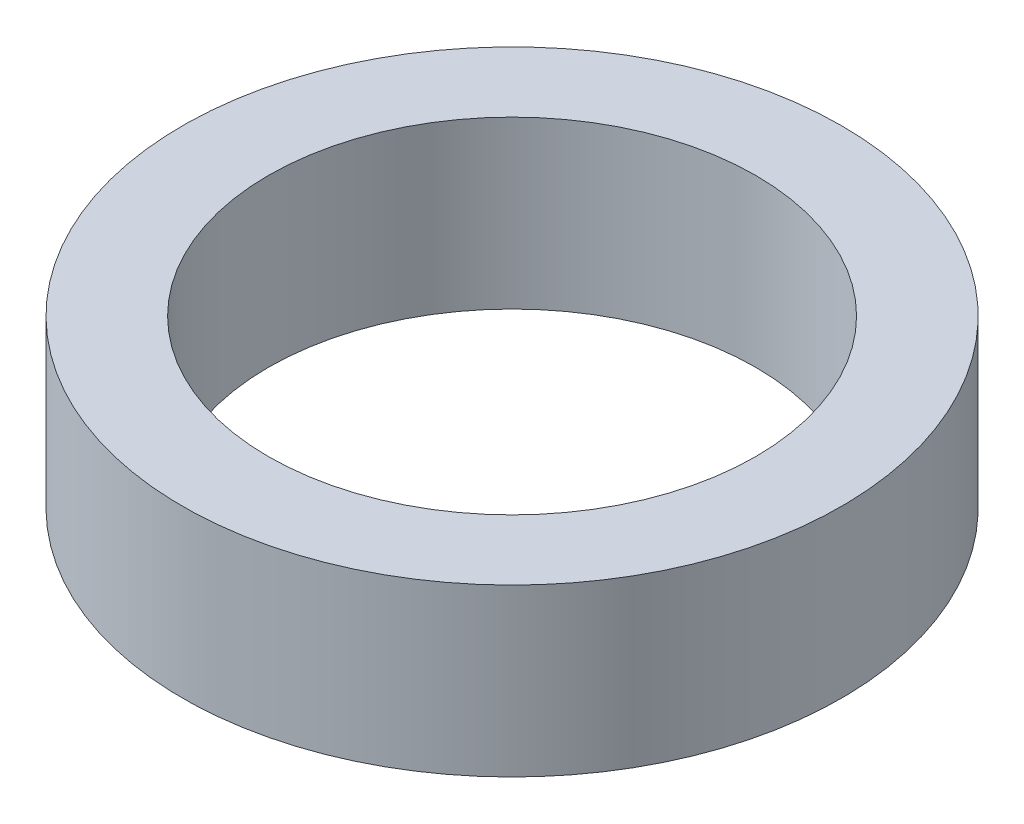
ISO-10303-21;
HEADER;
FILE_DESCRIPTION(('STEP AP214'),'2;1');
FILE_NAME('part.step','',(''),(''),'','','');
FILE_SCHEMA(('AUTOMOTIVE_DESIGN { 1 0 10303 214 1 1 1 1 }'));
ENDSEC;
DATA;
#1=APPLICATION_CONTEXT('core data for automotive mechanical design processes');
#2=APPLICATION_PROTOCOL_DEFINITION('international standard','automotive_design',2000,#1);
#3=PRODUCT_CONTEXT('',#1,'mechanical');
#4=PRODUCT('Part','Part','',(#3));
#5=PRODUCT_RELATED_PRODUCT_CATEGORY('part','',(#4));
#6=PRODUCT_DEFINITION_FORMATION('','',#4);
#7=PRODUCT_DEFINITION_CONTEXT('part definition',#1,'design');
#8=PRODUCT_DEFINITION('design','',#6,#7);
#9=PRODUCT_DEFINITION_SHAPE('','',#8);
#10=(LENGTH_UNIT() NAMED_UNIT(*) SI_UNIT(.MILLI.,.METRE.));
#11=(NAMED_UNIT(*) PLANE_ANGLE_UNIT() SI_UNIT($,.RADIAN.));
#12=(NAMED_UNIT(*) SI_UNIT($,.STERADIAN.) SOLID_ANGLE_UNIT());
#13=UNCERTAINTY_MEASURE_WITH_UNIT(LENGTH_MEASURE(1.E-05),#10,'distance_accuracy_value','');
#14=(GEOMETRIC_REPRESENTATION_CONTEXT(3) GLOBAL_UNCERTAINTY_ASSIGNED_CONTEXT((#13)) GLOBAL_UNIT_ASSIGNED_CONTEXT((#10,
#11,#12)) REPRESENTATION_CONTEXT('',''));
#15=CARTESIAN_POINT('',(0.,0.,0.));
#16=DIRECTION('',(0.,0.,1.));
#17=DIRECTION('',(1.,0.,0.));
#18=AXIS2_PLACEMENT_3D('',#15,#16,#17);
#19=CARTESIAN_POINT('',(0.,29.,0.));
#20=DIRECTION('',(0.,-1.,0.));
#21=DIRECTION('',(0.,0.,-1.));
#22=AXIS2_PLACEMENT_3D('',#19,#20,#21);
#23=CYLINDRICAL_SURFACE('',#22,57.5);
#24=CARTESIAN_POINT('',(0.,29.,0.));
#25=DIRECTION('',(0.,1.,0.));
#26=DIRECTION('',(0.,0.,1.));
#27=AXIS2_PLACEMENT_3D('',#24,#25,#26);
#28=CIRCLE('',#27,57.5);
#29=CARTESIAN_POINT('',(0.,29.,-57.5));
#30=VERTEX_POINT('',#29);
#31=EDGE_CURVE('E10',#30,#30,#28,.T.);
#32=CARTESIAN_POINT('',(0.,0.,0.));
#33=DIRECTION('',(0.,1.,0.));
#34=DIRECTION('',(0.,0.,1.));
#35=AXIS2_PLACEMENT_3D('',#32,#33,#34);
#36=CIRCLE('',#35,57.5);
#37=CARTESIAN_POINT('',(0.,0.,-57.5));
#38=VERTEX_POINT('',#37);
#39=EDGE_CURVE('E37',#38,#38,#36,.T.);
#40=CARTESIAN_POINT('',(0.,29.,-57.5));
#41=CARTESIAN_POINT('',(0.,28.6979166666667,-57.5));
#42=CARTESIAN_POINT('',(0.,28.3958333333333,-57.5));
#43=CARTESIAN_POINT('',(0.,27.7916666666667,-57.5));
#44=CARTESIAN_POINT('',(0.,27.4895833333333,-57.5));
#45=CARTESIAN_POINT('',(0.,26.8854166666667,-57.5));
#46=CARTESIAN_POINT('',(0.,26.5833333333333,-57.5));
#47=CARTESIAN_POINT('',(0.,25.9791666666667,-57.5));
#48=CARTESIAN_POINT('',(0.,25.6770833333333,-57.5));
#49=CARTESIAN_POINT('',(0.,25.0729166666667,-57.5));
#50=CARTESIAN_POINT('',(0.,24.7708333333333,-57.5));
#51=CARTESIAN_POINT('',(0.,24.1666666666667,-57.5));
#52=CARTESIAN_POINT('',(0.,23.8645833333333,-57.5));
#53=CARTESIAN_POINT('',(0.,23.2604166666667,-57.5));
#54=CARTESIAN_POINT('',(0.,22.9583333333333,-57.5));
#55=CARTESIAN_POINT('',(0.,22.3541666666667,-57.5));
#56=CARTESIAN_POINT('',(0.,22.0520833333333,-57.5));
#57=CARTESIAN_POINT('',(0.,21.4479166666667,-57.5));
#58=CARTESIAN_POINT('',(0.,21.1458333333333,-57.5));
#59=CARTESIAN_POINT('',(0.,20.5416666666667,-57.5));
#60=CARTESIAN_POINT('',(0.,20.2395833333333,-57.5));
#61=CARTESIAN_POINT('',(0.,19.6354166666667,-57.5));
#62=CARTESIAN_POINT('',(0.,19.3333333333333,-57.5));
#63=CARTESIAN_POINT('',(0.,18.7291666666667,-57.5));
#64=CARTESIAN_POINT('',(0.,18.4270833333333,-57.5));
#65=CARTESIAN_POINT('',(0.,17.8229166666667,-57.5));
#66=CARTESIAN_POINT('',(0.,17.5208333333333,-57.5));
#67=CARTESIAN_POINT('',(0.,16.9166666666667,-57.5));
#68=CARTESIAN_POINT('',(0.,16.6145833333333,-57.5));
#69=CARTESIAN_POINT('',(0.,16.0104166666667,-57.5));
#70=CARTESIAN_POINT('',(0.,15.7083333333333,-57.5));
#71=CARTESIAN_POINT('',(0.,15.1041666666667,-57.5));
#72=CARTESIAN_POINT('',(0.,14.8020833333333,-57.5));
#73=CARTESIAN_POINT('',(0.,14.1979166666667,-57.5));
#74=CARTESIAN_POINT('',(0.,13.8958333333333,-57.5));
#75=CARTESIAN_POINT('',(0.,13.2916666666667,-57.5));
#76=CARTESIAN_POINT('',(0.,12.9895833333333,-57.5));
#77=CARTESIAN_POINT('',(0.,12.3854166666667,-57.5));
#78=CARTESIAN_POINT('',(0.,12.0833333333333,-57.5));
#79=CARTESIAN_POINT('',(0.,11.4791666666667,-57.5));
#80=CARTESIAN_POINT('',(0.,11.1770833333333,-57.5));
#81=CARTESIAN_POINT('',(0.,10.5729166666667,-57.5));
#82=CARTESIAN_POINT('',(0.,10.2708333333333,-57.5));
#83=CARTESIAN_POINT('',(0.,9.66666666666667,-57.5));
#84=CARTESIAN_POINT('',(0.,9.36458333333333,-57.5));
#85=CARTESIAN_POINT('',(0.,8.76041666666667,-57.5));
#86=CARTESIAN_POINT('',(0.,8.45833333333333,-57.5));
#87=CARTESIAN_POINT('',(0.,7.85416666666667,-57.5));
#88=CARTESIAN_POINT('',(0.,7.55208333333333,-57.5));
#89=CARTESIAN_POINT('',(0.,6.94791666666667,-57.5));
#90=CARTESIAN_POINT('',(0.,6.64583333333333,-57.5));
#91=CARTESIAN_POINT('',(0.,6.04166666666667,-57.5));
#92=CARTESIAN_POINT('',(0.,5.73958333333333,-57.5));
#93=CARTESIAN_POINT('',(0.,5.13541666666667,-57.5));
#94=CARTESIAN_POINT('',(0.,4.83333333333333,-57.5));
#95=CARTESIAN_POINT('',(0.,4.22916666666667,-57.5));
#96=CARTESIAN_POINT('',(0.,3.92708333333333,-57.5));
#97=CARTESIAN_POINT('',(0.,3.32291666666667,-57.5));
#98=CARTESIAN_POINT('',(0.,3.02083333333333,-57.5));
#99=CARTESIAN_POINT('',(0.,2.41666666666667,-57.5));
#100=CARTESIAN_POINT('',(0.,2.11458333333333,-57.5));
#101=CARTESIAN_POINT('',(0.,1.51041666666667,-57.5));
#102=CARTESIAN_POINT('',(0.,1.20833333333333,-57.5));
#103=CARTESIAN_POINT('',(0.,0.604166666666667,-57.5));
#104=CARTESIAN_POINT('',(0.,0.302083333333333,-57.5));
#105=CARTESIAN_POINT('',(0.,0.,-57.5));
#106=B_SPLINE_CURVE_WITH_KNOTS('',3,(#40,#41,#42,#43,#44,#45,#46,#47,#48,#49,#50,#51,#52,#53,
#54,#55,#56,#57,#58,#59,#60,#61,#62,#63,#64,#65,#66,#67,#68,#69,#70,#71,#72,#73,#74,#75,#76,#77,
#78,#79,#80,#81,#82,#83,#84,#85,#86,#87,#88,#89,#90,#91,#92,#93,#94,#95,#96,#97,#98,#99,#100,
#101,#102,#103,#104,#105),.UNSPECIFIED.,.F.,.F.,(4,2,2,2,2,2,2,2,2,2,2,2,2,2,2,2,2,2,2,2,2,2,2,
2,2,2,2,2,2,2,2,2,4),(0.,0.906250000000001,1.8125,2.71875,3.625,4.53125,5.4375,6.34375,7.25,
8.15625,9.0625,9.96875,10.875,11.78125,12.6875,13.59375,14.5,15.40625,16.3125,17.21875,18.125,
19.03125,19.9375,20.84375,21.75,22.65625,23.5625,24.46875,25.375,26.28125,27.1875,28.09375,29.),.UNSPECIFIED.);
#107=EDGE_CURVE('BSEAM40',#30,#38,#106,.T.);
#108=ORIENTED_EDGE('',*,*,#31,.F.);
#109=ORIENTED_EDGE('',*,*,#39,.T.);
#110=ORIENTED_EDGE('',*,*,#107,.T.);
#111=ORIENTED_EDGE('',*,*,#107,.F.);
#112=EDGE_LOOP('',(#108,#110,#109,#111));
#113=FACE_BOUND('',#112,.T.);
#114=ADVANCED_FACE('F40',(#113),#23,.T.);
#115=CARTESIAN_POINT('',(0.,29.,0.));
#116=DIRECTION('',(0.,1.,0.));
#117=DIRECTION('',(0.,0.,1.));
#118=AXIS2_PLACEMENT_3D('',#115,#116,#117);
#119=PLANE('',#118);
#120=CARTESIAN_POINT('',(0.,29.,0.));
#121=DIRECTION('',(0.,1.,0.));
#122=DIRECTION('',(0.,0.,1.));
#123=AXIS2_PLACEMENT_3D('',#120,#121,#122);
#124=CIRCLE('',#123,42.5);
#125=CARTESIAN_POINT('',(0.,29.,-42.5));
#126=VERTEX_POINT('',#125);
#127=EDGE_CURVE('E50',#126,#126,#124,.T.);
#128=ORIENTED_EDGE('',*,*,#127,.F.);
#129=EDGE_LOOP('',(#128));
#130=FACE_BOUND('',#129,.T.);
#131=ORIENTED_EDGE('',*,*,#31,.T.);
#132=EDGE_LOOP('',(#131));
#133=FACE_BOUND('',#132,.T.);
#134=ADVANCED_FACE('F59',(#130,#133),#119,.T.);
#135=CARTESIAN_POINT('',(0.,0.,0.));
#136=DIRECTION('',(0.,1.,0.));
#137=DIRECTION('',(0.,0.,1.));
#138=AXIS2_PLACEMENT_3D('',#135,#136,#137);
#139=PLANE('',#138);
#140=CARTESIAN_POINT('',(0.,0.,0.));
#141=DIRECTION('',(0.,1.,0.));
#142=DIRECTION('',(0.,0.,1.));
#143=AXIS2_PLACEMENT_3D('',#140,#141,#142);
#144=CIRCLE('',#143,42.5);
#145=CARTESIAN_POINT('',(0.,0.,-42.5));
#146=VERTEX_POINT('',#145);
#147=EDGE_CURVE('E47',#146,#146,#144,.T.);
#148=ORIENTED_EDGE('',*,*,#147,.T.);
#149=EDGE_LOOP('',(#148));
#150=FACE_BOUND('',#149,.T.);
#151=ORIENTED_EDGE('',*,*,#39,.F.);
#152=EDGE_LOOP('',(#151));
#153=FACE_BOUND('',#152,.T.);
#154=ADVANCED_FACE('F58',(#150,#153),#139,.F.);
#155=CARTESIAN_POINT('',(0.,29.,0.));
#156=DIRECTION('',(0.,-1.,0.));
#157=DIRECTION('',(0.,0.,-1.));
#158=AXIS2_PLACEMENT_3D('',#155,#156,#157);
#159=CYLINDRICAL_SURFACE('',#158,42.5);
#160=CARTESIAN_POINT('',(0.,29.,-42.5));
#161=CARTESIAN_POINT('',(0.,28.6979166666667,-42.5));
#162=CARTESIAN_POINT('',(0.,28.3958333333333,-42.5));
#163=CARTESIAN_POINT('',(0.,27.7916666666667,-42.5));
#164=CARTESIAN_POINT('',(0.,27.4895833333333,-42.5));
#165=CARTESIAN_POINT('',(0.,26.8854166666667,-42.5));
#166=CARTESIAN_POINT('',(0.,26.5833333333333,-42.5));
#167=CARTESIAN_POINT('',(0.,25.9791666666667,-42.5));
#168=CARTESIAN_POINT('',(0.,25.6770833333333,-42.5));
#169=CARTESIAN_POINT('',(0.,25.0729166666667,-42.5));
#170=CARTESIAN_POINT('',(0.,24.7708333333333,-42.5));
#171=CARTESIAN_POINT('',(0.,24.1666666666667,-42.5));
#172=CARTESIAN_POINT('',(0.,23.8645833333333,-42.5));
#173=CARTESIAN_POINT('',(0.,23.2604166666667,-42.5));
#174=CARTESIAN_POINT('',(0.,22.9583333333333,-42.5));
#175=CARTESIAN_POINT('',(0.,22.3541666666667,-42.5));
#176=CARTESIAN_POINT('',(0.,22.0520833333333,-42.5));
#177=CARTESIAN_POINT('',(0.,21.4479166666667,-42.5));
#178=CARTESIAN_POINT('',(0.,21.1458333333333,-42.5));
#179=CARTESIAN_POINT('',(0.,20.5416666666667,-42.5));
#180=CARTESIAN_POINT('',(0.,20.2395833333333,-42.5));
#181=CARTESIAN_POINT('',(0.,19.6354166666667,-42.5));
#182=CARTESIAN_POINT('',(0.,19.3333333333333,-42.5));
#183=CARTESIAN_POINT('',(0.,18.7291666666667,-42.5));
#184=CARTESIAN_POINT('',(0.,18.4270833333333,-42.5));
#185=CARTESIAN_POINT('',(0.,17.8229166666667,-42.5));
#186=CARTESIAN_POINT('',(0.,17.5208333333333,-42.5));
#187=CARTESIAN_POINT('',(0.,16.9166666666667,-42.5));
#188=CARTESIAN_POINT('',(0.,16.6145833333333,-42.5));
#189=CARTESIAN_POINT('',(0.,16.0104166666667,-42.5));
#190=CARTESIAN_POINT('',(0.,15.7083333333333,-42.5));
#191=CARTESIAN_POINT('',(0.,15.1041666666667,-42.5));
#192=CARTESIAN_POINT('',(0.,14.8020833333333,-42.5));
#193=CARTESIAN_POINT('',(0.,14.1979166666667,-42.5));
#194=CARTESIAN_POINT('',(0.,13.8958333333333,-42.5));
#195=CARTESIAN_POINT('',(0.,13.2916666666667,-42.5));
#196=CARTESIAN_POINT('',(0.,12.9895833333333,-42.5));
#197=CARTESIAN_POINT('',(0.,12.3854166666667,-42.5));
#198=CARTESIAN_POINT('',(0.,12.0833333333333,-42.5));
#199=CARTESIAN_POINT('',(0.,11.4791666666667,-42.5));
#200=CARTESIAN_POINT('',(0.,11.1770833333333,-42.5));
#201=CARTESIAN_POINT('',(0.,10.5729166666667,-42.5));
#202=CARTESIAN_POINT('',(0.,10.2708333333333,-42.5));
#203=CARTESIAN_POINT('',(0.,9.66666666666667,-42.5));
#204=CARTESIAN_POINT('',(0.,9.36458333333333,-42.5));
#205=CARTESIAN_POINT('',(0.,8.76041666666667,-42.5));
#206=CARTESIAN_POINT('',(0.,8.45833333333333,-42.5));
#207=CARTESIAN_POINT('',(0.,7.85416666666667,-42.5));
#208=CARTESIAN_POINT('',(0.,7.55208333333333,-42.5));
#209=CARTESIAN_POINT('',(0.,6.94791666666667,-42.5));
#210=CARTESIAN_POINT('',(0.,6.64583333333333,-42.5));
#211=CARTESIAN_POINT('',(0.,6.04166666666667,-42.5));
#212=CARTESIAN_POINT('',(0.,5.73958333333333,-42.5));
#213=CARTESIAN_POINT('',(0.,5.13541666666667,-42.5));
#214=CARTESIAN_POINT('',(0.,4.83333333333333,-42.5));
#215=CARTESIAN_POINT('',(0.,4.22916666666667,-42.5));
#216=CARTESIAN_POINT('',(0.,3.92708333333333,-42.5));
#217=CARTESIAN_POINT('',(0.,3.32291666666667,-42.5));
#218=CARTESIAN_POINT('',(0.,3.02083333333333,-42.5));
#219=CARTESIAN_POINT('',(0.,2.41666666666667,-42.5));
#220=CARTESIAN_POINT('',(0.,2.11458333333333,-42.5));
#221=CARTESIAN_POINT('',(0.,1.51041666666667,-42.5));
#222=CARTESIAN_POINT('',(0.,1.20833333333333,-42.5));
#223=CARTESIAN_POINT('',(0.,0.604166666666667,-42.5));
#224=CARTESIAN_POINT('',(0.,0.302083333333333,-42.5));
#225=CARTESIAN_POINT('',(0.,0.,-42.5));
#226=B_SPLINE_CURVE_WITH_KNOTS('',3,(#160,#161,#162,#163,#164,#165,#166,#167,#168,#169,#170,
#171,#172,#173,#174,#175,#176,#177,#178,#179,#180,#181,#182,#183,#184,#185,#186,#187,#188,#189,
#190,#191,#192,#193,#194,#195,#196,#197,#198,#199,#200,#201,#202,#203,#204,#205,#206,#207,#208,
#209,#210,#211,#212,#213,#214,#215,#216,#217,#218,#219,#220,#221,#222,#223,#224,#225),
.UNSPECIFIED.,.F.,.F.,(4,2,2,2,2,2,2,2,2,2,2,2,2,2,2,2,2,2,2,2,2,2,2,2,2,2,2,2,2,2,2,2,4),(0.,
0.906249999999997,1.8125,2.71875,3.625,4.53125,5.4375,6.34375,7.25,8.15625,9.0625,9.96875,
10.875,11.78125,12.6875,13.59375,14.5,15.40625,16.3125,17.21875,18.125,19.03125,19.9375,
20.84375,21.75,22.65625,23.5625,24.46875,25.375,26.28125,27.1875,28.09375,29.),.UNSPECIFIED.);
#227=EDGE_CURVE('BSEAM54',#126,#146,#226,.T.);
#228=ORIENTED_EDGE('',*,*,#127,.T.);
#229=ORIENTED_EDGE('',*,*,#147,.F.);
#230=ORIENTED_EDGE('',*,*,#227,.T.);
#231=ORIENTED_EDGE('',*,*,#227,.F.);
#232=EDGE_LOOP('',(#228,#230,#229,#231));
#233=FACE_BOUND('',#232,.T.);
#234=ADVANCED_FACE('F54',(#233),#159,.F.);
#235=CLOSED_SHELL('',(#114,#134,#154,#234));
#236=MANIFOLD_SOLID_BREP('B2',#235);
#237=ADVANCED_BREP_SHAPE_REPRESENTATION('',(#18,#236),#14);
#238=SHAPE_DEFINITION_REPRESENTATION(#9,#237);
ENDSEC;
END-ISO-10303-21;
